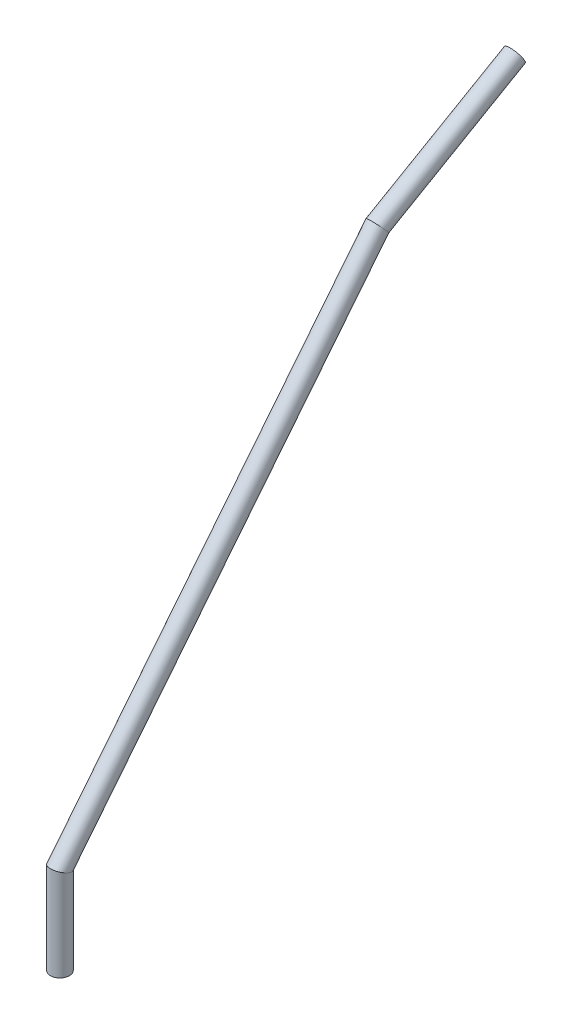
ISO-10303-21;
HEADER;
FILE_DESCRIPTION(('STEP AP214'),'2;1');
FILE_NAME('part.step','',(''),(''),'','','');
FILE_SCHEMA(('AUTOMOTIVE_DESIGN { 1 0 10303 214 1 1 1 1 }'));
ENDSEC;
DATA;
#1=APPLICATION_CONTEXT('core data for automotive mechanical design processes');
#2=APPLICATION_PROTOCOL_DEFINITION('international standard','automotive_design',2000,#1);
#3=PRODUCT_CONTEXT('',#1,'mechanical');
#4=PRODUCT('Part','Part','',(#3));
#5=PRODUCT_RELATED_PRODUCT_CATEGORY('part','',(#4));
#6=PRODUCT_DEFINITION_FORMATION('','',#4);
#7=PRODUCT_DEFINITION_CONTEXT('part definition',#1,'design');
#8=PRODUCT_DEFINITION('design','',#6,#7);
#9=PRODUCT_DEFINITION_SHAPE('','',#8);
#10=(LENGTH_UNIT() NAMED_UNIT(*) SI_UNIT(.MILLI.,.METRE.));
#11=(NAMED_UNIT(*) PLANE_ANGLE_UNIT() SI_UNIT($,.RADIAN.));
#12=(NAMED_UNIT(*) SI_UNIT($,.STERADIAN.) SOLID_ANGLE_UNIT());
#13=UNCERTAINTY_MEASURE_WITH_UNIT(LENGTH_MEASURE(1.E-05),#10,'distance_accuracy_value','');
#14=(GEOMETRIC_REPRESENTATION_CONTEXT(3) GLOBAL_UNCERTAINTY_ASSIGNED_CONTEXT((#13)) GLOBAL_UNIT_ASSIGNED_CONTEXT((#10,
#11,#12)) REPRESENTATION_CONTEXT('',''));
#15=CARTESIAN_POINT('',(0.,0.,0.));
#16=DIRECTION('',(0.,0.,1.));
#17=DIRECTION('',(1.,0.,0.));
#18=AXIS2_PLACEMENT_3D('',#15,#16,#17);
#19=CARTESIAN_POINT('',(0.,244.456479744694,-167.058595302867));
#20=DIRECTION('',(0.,0.500000000000001,-0.866025403784438));
#21=DIRECTION('',(0.,0.866025403784438,0.500000000000001));
#22=AXIS2_PLACEMENT_3D('',#19,#20,#21);
#23=CYLINDRICAL_SURFACE('',#22,4.7625);
#24=CARTESIAN_POINT('',(0.,245.,-168.));
#25=DIRECTION('',(0.,0.651702625405582,-0.75847457969234));
#26=DIRECTION('',(0.,0.75847457969234,0.651702625405582));
#27=AXIS2_PLACEMENT_3D('',#24,#25,#26);
#28=ELLIPSE('',#27,4.84629453166824,4.7625);
#29=CARTESIAN_POINT('',(0.,248.675791207972,-164.841657130223));
#30=VERTEX_POINT('',#29);
#31=EDGE_CURVE('E116',#30,#30,#28,.F.);
#32=ORIENTED_EDGE('',*,*,#31,.F.);
#33=EDGE_LOOP('',(#32));
#34=FACE_BOUND('',#33,.T.);
#35=CARTESIAN_POINT('',(0.,285.,-237.282032302755));
#36=DIRECTION('',(0.,0.500000000000001,-0.866025403784438));
#37=DIRECTION('',(0.,0.866025403784438,0.500000000000001));
#38=AXIS2_PLACEMENT_3D('',#35,#36,#37);
#39=CIRCLE('',#38,4.7625);
#40=CARTESIAN_POINT('',(0.,289.124445985523,-234.900782302755));
#41=VERTEX_POINT('',#40);
#42=EDGE_CURVE('E137',#41,#41,#39,.T.);
#43=ORIENTED_EDGE('',*,*,#42,.F.);
#44=EDGE_LOOP('',(#43));
#45=FACE_BOUND('',#44,.T.);
#46=DIRECTION('',(0.,0.500000000000001,-0.866025403784438));
#47=VECTOR('',#46,1.);
#48=CARTESIAN_POINT('',(-2.,240.713345404665,-169.219694921695));
#49=LINE('',#48,#47);
#50=CARTESIAN_POINT('',(-2.,262.256865659972,-206.534166577775));
#51=VERTEX_POINT('',#50);
#52=CARTESIAN_POINT('',(-2.,266.256865659972,-213.46236980805));
#53=VERTEX_POINT('',#52);
#54=EDGE_CURVE('E85',#51,#53,#49,.T.);
#55=ORIENTED_EDGE('',*,*,#54,.F.);
#56=CARTESIAN_POINT('',(0.,266.,-204.373066958947));
#57=DIRECTION('',(0.,0.500000000000001,-0.866025403784438));
#58=DIRECTION('',(0.,0.866025403784438,0.500000000000001));
#59=AXIS2_PLACEMENT_3D('',#56,#57,#58);
#60=CIRCLE('',#59,4.7625);
#61=CARTESIAN_POINT('',(2.,262.256865659972,-206.534166577775));
#62=VERTEX_POINT('',#61);
#63=EDGE_CURVE('E94',#51,#62,#60,.F.);
#64=ORIENTED_EDGE('',*,*,#63,.T.);
#65=DIRECTION('',(0.,0.500000000000001,-0.866025403784438));
#66=VECTOR('',#65,1.);
#67=CARTESIAN_POINT('',(2.,240.713345404665,-169.219694921695));
#68=LINE('',#67,#66);
#69=CARTESIAN_POINT('',(2.,266.256865659972,-213.46236980805));
#70=VERTEX_POINT('',#69);
#71=EDGE_CURVE('E93',#70,#62,#68,.F.);
#72=ORIENTED_EDGE('',*,*,#71,.F.);
#73=CARTESIAN_POINT('',(0.,270.,-211.301270189222));
#74=DIRECTION('',(0.,0.500000000000001,-0.866025403784438));
#75=DIRECTION('',(0.,0.866025403784438,0.500000000000001));
#76=AXIS2_PLACEMENT_3D('',#73,#74,#75);
#77=CIRCLE('',#76,4.7625);
#78=EDGE_CURVE('E97',#53,#70,#77,.F.);
#79=ORIENTED_EDGE('',*,*,#78,.F.);
#80=EDGE_LOOP('',(#55,#64,#72,#79));
#81=FACE_BOUND('',#80,.T.);
#82=ADVANCED_FACE('F44',(#34,#45,#81),#23,.T.);
#83=CARTESIAN_POINT('',(0.,244.620986496463,-167.343529355118));
#84=DIRECTION('',(0.,0.500000000000001,-0.866025403784438));
#85=DIRECTION('',(0.,0.866025403784438,0.500000000000001));
#86=AXIS2_PLACEMENT_3D('',#83,#84,#85);
#87=CYLINDRICAL_SURFACE('',#86,3.175);
#88=CARTESIAN_POINT('',(0.,245.,-168.));
#89=DIRECTION('',(0.,0.651702625405582,-0.75847457969234));
#90=DIRECTION('',(0.,0.75847457969234,0.651702625405582));
#91=AXIS2_PLACEMENT_3D('',#88,#89,#90);
#92=ELLIPSE('',#91,3.23086302111216,3.175);
#93=CARTESIAN_POINT('',(0.,247.450527471982,-165.894438086815));
#94=VERTEX_POINT('',#93);
#95=EDGE_CURVE('E122',#94,#94,#92,.T.);
#96=ORIENTED_EDGE('',*,*,#95,.F.);
#97=EDGE_LOOP('',(#96));
#98=FACE_BOUND('',#97,.T.);
#99=CARTESIAN_POINT('',(0.,285.,-237.282032302755));
#100=DIRECTION('',(0.,0.500000000000001,-0.866025403784438));
#101=DIRECTION('',(0.,0.866025403784438,0.500000000000001));
#102=AXIS2_PLACEMENT_3D('',#99,#100,#101);
#103=CIRCLE('',#102,3.175);
#104=CARTESIAN_POINT('',(0.,287.749630657016,-235.694532302755));
#105=VERTEX_POINT('',#104);
#106=EDGE_CURVE('E129',#105,#105,#103,.F.);
#107=ORIENTED_EDGE('',*,*,#106,.F.);
#108=EDGE_LOOP('',(#107));
#109=FACE_BOUND('',#108,.T.);
#110=DIRECTION('',(0.,0.500000000000001,-0.866025403784438));
#111=VECTOR('',#110,1.);
#112=CARTESIAN_POINT('',(2.,242.485461092727,-168.576475521826));
#113=LINE('',#112,#111);
#114=CARTESIAN_POINT('',(2.,263.864474596265,-205.606013125655));
#115=VERTEX_POINT('',#114);
#116=CARTESIAN_POINT('',(2.,267.864474596265,-212.53421635593));
#117=VERTEX_POINT('',#116);
#118=EDGE_CURVE('E52',#115,#117,#113,.T.);
#119=ORIENTED_EDGE('',*,*,#118,.F.);
#120=CARTESIAN_POINT('',(0.,266.,-204.373066958947));
#121=DIRECTION('',(0.,0.500000000000001,-0.866025403784438));
#122=DIRECTION('',(0.,0.866025403784438,0.500000000000001));
#123=AXIS2_PLACEMENT_3D('',#120,#121,#122);
#124=CIRCLE('',#123,3.175);
#125=CARTESIAN_POINT('',(-2.,263.864474596265,-205.606013125655));
#126=VERTEX_POINT('',#125);
#127=EDGE_CURVE('E11',#115,#126,#124,.T.);
#128=ORIENTED_EDGE('',*,*,#127,.T.);
#129=DIRECTION('',(0.,0.500000000000001,-0.866025403784438));
#130=VECTOR('',#129,1.);
#131=CARTESIAN_POINT('',(-2.,242.485461092727,-168.576475521826));
#132=LINE('',#131,#130);
#133=CARTESIAN_POINT('',(-2.,267.864474596265,-212.53421635593));
#134=VERTEX_POINT('',#133);
#135=EDGE_CURVE('E67',#134,#126,#132,.F.);
#136=ORIENTED_EDGE('',*,*,#135,.F.);
#137=CARTESIAN_POINT('',(0.,270.,-211.301270189222));
#138=DIRECTION('',(0.,0.500000000000001,-0.866025403784438));
#139=DIRECTION('',(0.,0.866025403784438,0.500000000000001));
#140=AXIS2_PLACEMENT_3D('',#137,#138,#139);
#141=CIRCLE('',#140,3.175);
#142=EDGE_CURVE('E99',#117,#134,#141,.T.);
#143=ORIENTED_EDGE('',*,*,#142,.F.);
#144=EDGE_LOOP('',(#119,#128,#136,#143));
#145=FACE_BOUND('',#144,.T.);
#146=ADVANCED_FACE('F157',(#98,#109,#145),#87,.F.);
#147=CARTESIAN_POINT('',(0.,43.4869462133928,-6.78955697071423));
#148=DIRECTION('',(0.,0.78086880944303,-0.624695047554424));
#149=DIRECTION('',(0.,0.624695047554424,0.78086880944303));
#150=AXIS2_PLACEMENT_3D('',#147,#148,#149);
#151=CYLINDRICAL_SURFACE('',#150,4.7625);
#152=CARTESIAN_POINT('',(0.,45.,-8.));
#153=DIRECTION('',(0.,0.943628319160418,-0.3310069414355));
#154=DIRECTION('',(0.,0.3310069414355,0.943628319160418));
#155=AXIS2_PLACEMENT_3D('',#152,#153,#154);
#156=ELLIPSE('',#155,5.04700834353655,4.7625);
#157=CARTESIAN_POINT('',(0.,46.6705947951935,-3.2375));
#158=VERTEX_POINT('',#157);
#159=EDGE_CURVE('E141',#158,#158,#156,.F.);
#160=ORIENTED_EDGE('',*,*,#159,.F.);
#161=EDGE_LOOP('',(#160));
#162=FACE_BOUND('',#161,.T.);
#163=ORIENTED_EDGE('',*,*,#31,.T.);
#164=EDGE_LOOP('',(#163));
#165=FACE_BOUND('',#164,.T.);
#166=ADVANCED_FACE('F177',(#162,#165),#151,.T.);
#167=CARTESIAN_POINT('',(0.,0.,-8.));
#168=DIRECTION('',(0.,1.,0.));
#169=DIRECTION('',(0.,0.,1.));
#170=AXIS2_PLACEMENT_3D('',#167,#168,#169);
#171=CYLINDRICAL_SURFACE('',#170,4.7625);
#172=CARTESIAN_POINT('',(0.,0.,-8.));
#173=DIRECTION('',(0.,1.,0.));
#174=DIRECTION('',(0.,0.,1.));
#175=AXIS2_PLACEMENT_3D('',#172,#173,#174);
#176=CIRCLE('',#175,4.7625);
#177=CARTESIAN_POINT('',(0.,0.,-3.2375));
#178=VERTEX_POINT('',#177);
#179=EDGE_CURVE('E133',#178,#178,#176,.T.);
#180=ORIENTED_EDGE('',*,*,#179,.T.);
#181=EDGE_LOOP('',(#180));
#182=FACE_BOUND('',#181,.T.);
#183=ORIENTED_EDGE('',*,*,#159,.T.);
#184=EDGE_LOOP('',(#183));
#185=FACE_BOUND('',#184,.T.);
#186=ADVANCED_FACE('F188',(#182,#185),#171,.T.);
#187=CARTESIAN_POINT('',(0.,285.,-237.282032302755));
#188=DIRECTION('',(0.,0.500000000000001,-0.866025403784438));
#189=DIRECTION('',(0.,0.866025403784438,0.500000000000001));
#190=AXIS2_PLACEMENT_3D('',#187,#188,#189);
#191=PLANE('',#190);
#192=ORIENTED_EDGE('',*,*,#106,.T.);
#193=EDGE_LOOP('',(#192));
#194=FACE_BOUND('',#193,.T.);
#195=ORIENTED_EDGE('',*,*,#42,.T.);
#196=EDGE_LOOP('',(#195));
#197=FACE_BOUND('',#196,.T.);
#198=ADVANCED_FACE('F185',(#194,#197),#191,.T.);
#199=CARTESIAN_POINT('',(0.,0.,-8.));
#200=DIRECTION('',(0.,1.,0.));
#201=DIRECTION('',(0.,0.,1.));
#202=AXIS2_PLACEMENT_3D('',#199,#200,#201);
#203=PLANE('',#202);
#204=CARTESIAN_POINT('',(0.,0.,-8.));
#205=DIRECTION('',(0.,1.,0.));
#206=DIRECTION('',(0.,0.,1.));
#207=AXIS2_PLACEMENT_3D('',#204,#205,#206);
#208=CIRCLE('',#207,3.175);
#209=CARTESIAN_POINT('',(0.,0.,-4.825));
#210=VERTEX_POINT('',#209);
#211=EDGE_CURVE('E117',#210,#210,#208,.F.);
#212=ORIENTED_EDGE('',*,*,#211,.F.);
#213=EDGE_LOOP('',(#212));
#214=FACE_BOUND('',#213,.T.);
#215=ORIENTED_EDGE('',*,*,#179,.F.);
#216=EDGE_LOOP('',(#215));
#217=FACE_BOUND('',#216,.T.);
#218=ADVANCED_FACE('F187',(#214,#217),#203,.F.);
#219=CARTESIAN_POINT('',(0.,43.9652685152804,-7.17221481222433));
#220=DIRECTION('',(0.,0.78086880944303,-0.624695047554424));
#221=DIRECTION('',(0.,0.624695047554424,0.78086880944303));
#222=AXIS2_PLACEMENT_3D('',#219,#220,#221);
#223=CYLINDRICAL_SURFACE('',#222,3.175);
#224=CARTESIAN_POINT('',(0.,45.,-8.));
#225=DIRECTION('',(0.,0.943628319160418,-0.3310069414355));
#226=DIRECTION('',(0.,0.3310069414355,0.943628319160418));
#227=AXIS2_PLACEMENT_3D('',#224,#225,#226);
#228=ELLIPSE('',#227,3.36467222902437,3.175);
#229=CARTESIAN_POINT('',(0.,46.1137298634623,-4.825));
#230=VERTEX_POINT('',#229);
#231=EDGE_CURVE('E121',#230,#230,#228,.T.);
#232=ORIENTED_EDGE('',*,*,#231,.F.);
#233=EDGE_LOOP('',(#232));
#234=FACE_BOUND('',#233,.T.);
#235=ORIENTED_EDGE('',*,*,#95,.T.);
#236=EDGE_LOOP('',(#235));
#237=FACE_BOUND('',#236,.T.);
#238=ADVANCED_FACE('F195',(#234,#237),#223,.F.);
#239=CARTESIAN_POINT('',(0.,0.,-8.));
#240=DIRECTION('',(0.,1.,0.));
#241=DIRECTION('',(0.,0.,1.));
#242=AXIS2_PLACEMENT_3D('',#239,#240,#241);
#243=CYLINDRICAL_SURFACE('',#242,3.175);
#244=ORIENTED_EDGE('',*,*,#211,.T.);
#245=EDGE_LOOP('',(#244));
#246=FACE_BOUND('',#245,.T.);
#247=ORIENTED_EDGE('',*,*,#231,.T.);
#248=EDGE_LOOP('',(#247));
#249=FACE_BOUND('',#248,.T.);
#250=ADVANCED_FACE('F180',(#246,#249),#243,.F.);
#251=CARTESIAN_POINT('',(2.,266.,-204.373066958946));
#252=DIRECTION('',(1.,0.,0.));
#253=DIRECTION('',(0.,0.,-1.));
#254=AXIS2_PLACEMENT_3D('',#251,#252,#253);
#255=PLANE('',#254);
#256=ORIENTED_EDGE('',*,*,#71,.T.);
#257=DIRECTION('',(0.,-0.866025403784438,-0.500000000000001));
#258=VECTOR('',#257,1.);
#259=CARTESIAN_POINT('',(2.,266.,-204.373066958946));
#260=LINE('',#259,#258);
#261=EDGE_CURVE('E105',#115,#62,#260,.T.);
#262=ORIENTED_EDGE('',*,*,#261,.F.);
#263=ORIENTED_EDGE('',*,*,#118,.T.);
#264=DIRECTION('',(0.,-0.866025403784438,-0.500000000000001));
#265=VECTOR('',#264,1.);
#266=CARTESIAN_POINT('',(2.,270.,-211.301270189222));
#267=LINE('',#266,#265);
#268=EDGE_CURVE('E59',#117,#70,#267,.T.);
#269=ORIENTED_EDGE('',*,*,#268,.T.);
#270=EDGE_LOOP('',(#256,#262,#263,#269));
#271=FACE_BOUND('',#270,.T.);
#272=ADVANCED_FACE('F155',(#271),#255,.F.);
#273=CARTESIAN_POINT('',(-2.,261.875554014477,-206.754316958946));
#274=DIRECTION('',(-1.,0.,0.));
#275=DIRECTION('',(0.,-1.,0.));
#276=AXIS2_PLACEMENT_3D('',#273,#274,#275);
#277=PLANE('',#276);
#278=ORIENTED_EDGE('',*,*,#54,.T.);
#279=DIRECTION('',(0.,0.866025403784438,0.500000000000001));
#280=VECTOR('',#279,1.);
#281=CARTESIAN_POINT('',(-2.,265.875554014477,-213.682520189222));
#282=LINE('',#281,#280);
#283=EDGE_CURVE('E88',#53,#134,#282,.T.);
#284=ORIENTED_EDGE('',*,*,#283,.T.);
#285=ORIENTED_EDGE('',*,*,#135,.T.);
#286=DIRECTION('',(0.,0.866025403784438,0.500000000000001));
#287=VECTOR('',#286,1.);
#288=CARTESIAN_POINT('',(-2.,261.875554014477,-206.754316958946));
#289=LINE('',#288,#287);
#290=EDGE_CURVE('E89',#51,#126,#289,.T.);
#291=ORIENTED_EDGE('',*,*,#290,.F.);
#292=EDGE_LOOP('',(#278,#284,#285,#291));
#293=FACE_BOUND('',#292,.T.);
#294=ADVANCED_FACE('F87',(#293),#277,.F.);
#295=CARTESIAN_POINT('',(0.,154.996133917893,-268.46117892254));
#296=DIRECTION('',(0.,0.500000000000001,-0.866025403784438));
#297=DIRECTION('',(0.,0.866025403784438,0.500000000000001));
#298=AXIS2_PLACEMENT_3D('',#295,#296,#297);
#299=PLANE('',#298);
#300=ORIENTED_EDGE('',*,*,#290,.T.);
#301=ORIENTED_EDGE('',*,*,#127,.F.);
#302=ORIENTED_EDGE('',*,*,#261,.T.);
#303=ORIENTED_EDGE('',*,*,#63,.F.);
#304=EDGE_LOOP('',(#300,#301,#302,#303));
#305=FACE_BOUND('',#304,.T.);
#306=ADVANCED_FACE('F159',(#305),#299,.T.);
#307=CARTESIAN_POINT('',(0.,158.996133917893,-275.389382152816));
#308=DIRECTION('',(0.,0.500000000000001,-0.866025403784438));
#309=DIRECTION('',(0.,0.866025403784438,0.500000000000001));
#310=AXIS2_PLACEMENT_3D('',#307,#308,#309);
#311=PLANE('',#310);
#312=ORIENTED_EDGE('',*,*,#78,.T.);
#313=ORIENTED_EDGE('',*,*,#268,.F.);
#314=ORIENTED_EDGE('',*,*,#142,.T.);
#315=ORIENTED_EDGE('',*,*,#283,.F.);
#316=EDGE_LOOP('',(#312,#313,#314,#315));
#317=FACE_BOUND('',#316,.T.);
#318=ADVANCED_FACE('F96',(#317),#311,.F.);
#319=CLOSED_SHELL('',(#82,#146,#166,#186,#198,#218,#238,#250,#272,#294,#306,#318));
#320=MANIFOLD_SOLID_BREP('B2',#319);
#321=ADVANCED_BREP_SHAPE_REPRESENTATION('',(#18,#320),#14);
#322=SHAPE_DEFINITION_REPRESENTATION(#9,#321);
ENDSEC;
END-ISO-10303-21;
